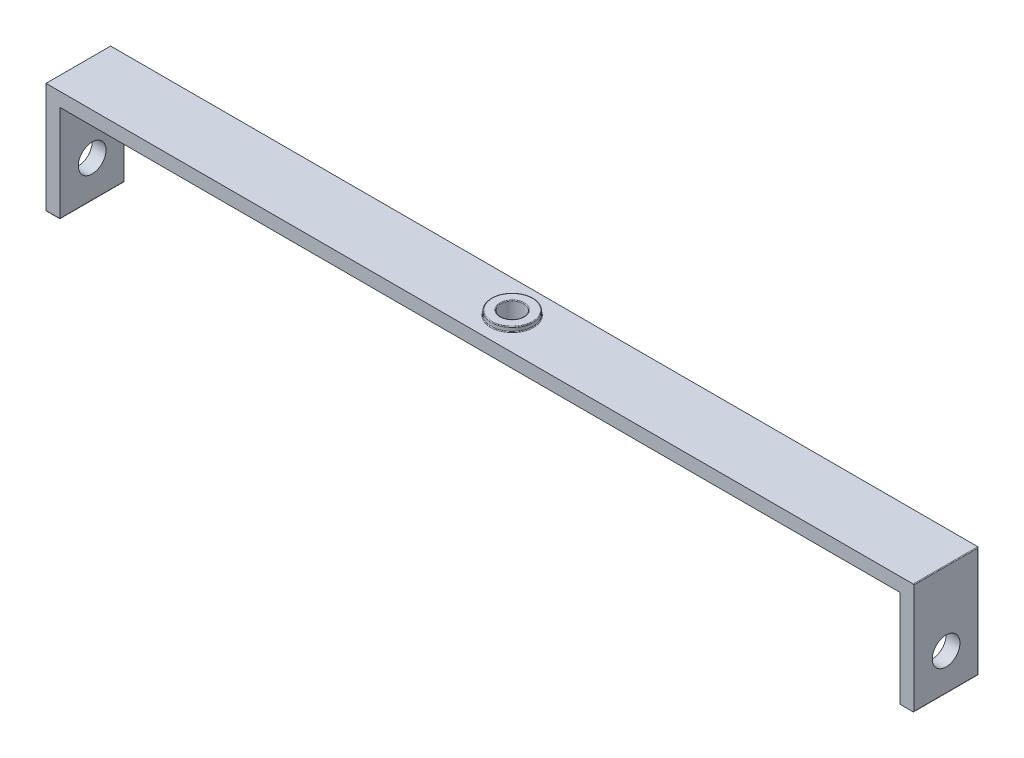
ISO-10303-21;
HEADER;
FILE_DESCRIPTION(('STEP AP214'),'2;1');
FILE_NAME('part.step','',(''),(''),'','','');
FILE_SCHEMA(('AUTOMOTIVE_DESIGN { 1 0 10303 214 1 1 1 1 }'));
ENDSEC;
DATA;
#1=APPLICATION_CONTEXT('core data for automotive mechanical design processes');
#2=APPLICATION_PROTOCOL_DEFINITION('international standard','automotive_design',2000,#1);
#3=PRODUCT_CONTEXT('',#1,'mechanical');
#4=PRODUCT('Part','Part','',(#3));
#5=PRODUCT_RELATED_PRODUCT_CATEGORY('part','',(#4));
#6=PRODUCT_DEFINITION_FORMATION('','',#4);
#7=PRODUCT_DEFINITION_CONTEXT('part definition',#1,'design');
#8=PRODUCT_DEFINITION('design','',#6,#7);
#9=PRODUCT_DEFINITION_SHAPE('','',#8);
#10=(LENGTH_UNIT() NAMED_UNIT(*) SI_UNIT(.MILLI.,.METRE.));
#11=(NAMED_UNIT(*) PLANE_ANGLE_UNIT() SI_UNIT($,.RADIAN.));
#12=(NAMED_UNIT(*) SI_UNIT($,.STERADIAN.) SOLID_ANGLE_UNIT());
#13=UNCERTAINTY_MEASURE_WITH_UNIT(LENGTH_MEASURE(1.E-05),#10,'distance_accuracy_value','');
#14=(GEOMETRIC_REPRESENTATION_CONTEXT(3) GLOBAL_UNCERTAINTY_ASSIGNED_CONTEXT((#13)) GLOBAL_UNIT_ASSIGNED_CONTEXT((#10,
#11,#12)) REPRESENTATION_CONTEXT('',''));
#15=CARTESIAN_POINT('',(0.,0.,0.));
#16=DIRECTION('',(0.,0.,1.));
#17=DIRECTION('',(1.,0.,0.));
#18=AXIS2_PLACEMENT_3D('',#15,#16,#17);
#19=CARTESIAN_POINT('',(-47.,0.,3.5));
#20=DIRECTION('',(0.,-1.,0.));
#21=DIRECTION('',(0.,0.,-1.));
#22=AXIS2_PLACEMENT_3D('',#19,#20,#21);
#23=PLANE('',#22);
#24=CARTESIAN_POINT('',(0.,0.,0.));
#25=DIRECTION('',(0.,-1.,0.));
#26=DIRECTION('',(0.,0.,-1.));
#27=AXIS2_PLACEMENT_3D('',#24,#25,#26);
#28=CIRCLE('',#27,2.325);
#29=CARTESIAN_POINT('',(0.,0.,-2.325));
#30=VERTEX_POINT('',#29);
#31=EDGE_CURVE('E251',#30,#30,#28,.T.);
#32=ORIENTED_EDGE('',*,*,#31,.T.);
#33=EDGE_LOOP('',(#32));
#34=FACE_BOUND('',#33,.T.);
#35=DIRECTION('',(-1.,0.,0.));
#36=VECTOR('',#35,1.);
#37=CARTESIAN_POINT('',(-47.,0.,3.5));
#38=LINE('',#37,#36);
#39=CARTESIAN_POINT('',(46.925,0.,3.5));
#40=VERTEX_POINT('',#39);
#41=CARTESIAN_POINT('',(-47.,0.,3.5));
#42=VERTEX_POINT('',#41);
#43=EDGE_CURVE('E163',#40,#42,#38,.T.);
#44=ORIENTED_EDGE('',*,*,#43,.F.);
#45=DIRECTION('',(0.,0.,-1.));
#46=VECTOR('',#45,1.);
#47=CARTESIAN_POINT('',(46.925,0.,3.5));
#48=LINE('',#47,#46);
#49=CARTESIAN_POINT('',(46.925,0.,-3.5));
#50=VERTEX_POINT('',#49);
#51=EDGE_CURVE('E249',#40,#50,#48,.T.);
#52=ORIENTED_EDGE('',*,*,#51,.T.);
#53=DIRECTION('',(-1.,0.,0.));
#54=VECTOR('',#53,1.);
#55=CARTESIAN_POINT('',(-47.,0.,-3.5));
#56=LINE('',#55,#54);
#57=CARTESIAN_POINT('',(-47.,0.,-3.5));
#58=VERTEX_POINT('',#57);
#59=EDGE_CURVE('E180',#50,#58,#56,.T.);
#60=ORIENTED_EDGE('',*,*,#59,.T.);
#61=DIRECTION('',(0.,0.,-1.));
#62=VECTOR('',#61,1.);
#63=CARTESIAN_POINT('',(-47.,0.,3.5));
#64=LINE('',#63,#62);
#65=EDGE_CURVE('E178',#42,#58,#64,.T.);
#66=ORIENTED_EDGE('',*,*,#65,.F.);
#67=EDGE_LOOP('',(#44,#52,#60,#66));
#68=FACE_BOUND('',#67,.T.);
#69=ADVANCED_FACE('F35',(#34,#68),#23,.F.);
#70=CARTESIAN_POINT('',(45.5,-12.,3.5));
#71=DIRECTION('',(0.,1.,0.));
#72=DIRECTION('',(0.,0.,1.));
#73=AXIS2_PLACEMENT_3D('',#70,#71,#72);
#74=PLANE('',#73);
#75=DIRECTION('',(1.,0.,0.));
#76=VECTOR('',#75,1.);
#77=CARTESIAN_POINT('',(47.,-12.,-3.425));
#78=LINE('',#77,#76);
#79=CARTESIAN_POINT('',(45.575,-12.,-3.425));
#80=VERTEX_POINT('',#79);
#81=CARTESIAN_POINT('',(46.925,-12.,-3.425));
#82=VERTEX_POINT('',#81);
#83=EDGE_CURVE('E260',#80,#82,#78,.T.);
#84=ORIENTED_EDGE('',*,*,#83,.T.);
#85=DIRECTION('',(0.,0.,-1.));
#86=VECTOR('',#85,1.);
#87=CARTESIAN_POINT('',(46.925,-12.,3.5));
#88=LINE('',#87,#86);
#89=CARTESIAN_POINT('',(46.925,-12.,3.5));
#90=VERTEX_POINT('',#89);
#91=EDGE_CURVE('E264',#82,#90,#88,.F.);
#92=ORIENTED_EDGE('',*,*,#91,.T.);
#93=DIRECTION('',(1.,0.,0.));
#94=VECTOR('',#93,1.);
#95=CARTESIAN_POINT('',(45.5,-12.,3.5));
#96=LINE('',#95,#94);
#97=CARTESIAN_POINT('',(45.575,-12.,3.5));
#98=VERTEX_POINT('',#97);
#99=EDGE_CURVE('E204',#98,#90,#96,.T.);
#100=ORIENTED_EDGE('',*,*,#99,.F.);
#101=DIRECTION('',(0.,0.,-1.));
#102=VECTOR('',#101,1.);
#103=CARTESIAN_POINT('',(45.575,-12.,3.5));
#104=LINE('',#103,#102);
#105=EDGE_CURVE('E262',#98,#80,#104,.T.);
#106=ORIENTED_EDGE('',*,*,#105,.T.);
#107=EDGE_LOOP('',(#84,#92,#100,#106));
#108=FACE_BOUND('',#107,.T.);
#109=ADVANCED_FACE('F445',(#108),#74,.F.);
#110=CARTESIAN_POINT('',(47.,0.,3.5));
#111=DIRECTION('',(-1.,0.,0.));
#112=DIRECTION('',(0.,0.,1.));
#113=AXIS2_PLACEMENT_3D('',#110,#111,#112);
#114=PLANE('',#113);
#115=DIRECTION('',(0.,1.,0.));
#116=VECTOR('',#115,1.);
#117=CARTESIAN_POINT('',(47.,0.,3.5));
#118=LINE('',#117,#116);
#119=CARTESIAN_POINT('',(47.,-11.925,3.5));
#120=VERTEX_POINT('',#119);
#121=CARTESIAN_POINT('',(47.,-0.075,3.5));
#122=VERTEX_POINT('',#121);
#123=EDGE_CURVE('E175',#120,#122,#118,.T.);
#124=ORIENTED_EDGE('',*,*,#123,.F.);
#125=DIRECTION('',(0.,0.,-1.));
#126=VECTOR('',#125,1.);
#127=CARTESIAN_POINT('',(47.,-11.925,3.5));
#128=LINE('',#127,#126);
#129=CARTESIAN_POINT('',(47.,-11.925,-3.425));
#130=VERTEX_POINT('',#129);
#131=EDGE_CURVE('E258',#120,#130,#128,.T.);
#132=ORIENTED_EDGE('',*,*,#131,.T.);
#133=DIRECTION('',(0.,1.,0.));
#134=VECTOR('',#133,1.);
#135=CARTESIAN_POINT('',(47.,0.,-3.425));
#136=LINE('',#135,#134);
#137=CARTESIAN_POINT('',(47.,-0.075,-3.425));
#138=VERTEX_POINT('',#137);
#139=EDGE_CURVE('E254',#130,#138,#136,.T.);
#140=ORIENTED_EDGE('',*,*,#139,.T.);
#141=DIRECTION('',(0.,0.,-1.));
#142=VECTOR('',#141,1.);
#143=CARTESIAN_POINT('',(47.,-0.075,3.5));
#144=LINE('',#143,#142);
#145=EDGE_CURVE('E256',#138,#122,#144,.F.);
#146=ORIENTED_EDGE('',*,*,#145,.T.);
#147=EDGE_LOOP('',(#124,#132,#140,#146));
#148=FACE_BOUND('',#147,.T.);
#149=CARTESIAN_POINT('',(47.,-8.,0.));
#150=DIRECTION('',(1.,0.,0.));
#151=DIRECTION('',(0.,0.,-1.));
#152=AXIS2_PLACEMENT_3D('',#149,#150,#151);
#153=CIRCLE('',#152,1.5);
#154=CARTESIAN_POINT('',(47.,-8.,-1.5));
#155=VERTEX_POINT('',#154);
#156=EDGE_CURVE('E355',#155,#155,#153,.T.);
#157=ORIENTED_EDGE('',*,*,#156,.F.);
#158=EDGE_LOOP('',(#157));
#159=FACE_BOUND('',#158,.T.);
#160=ADVANCED_FACE('F450',(#148,#159),#114,.F.);
#161=CARTESIAN_POINT('',(-47.,0.,3.5));
#162=DIRECTION('',(1.,0.,0.));
#163=DIRECTION('',(0.,0.,-1.));
#164=AXIS2_PLACEMENT_3D('',#161,#162,#163);
#165=PLANE('',#164);
#166=CARTESIAN_POINT('',(-47.,-8.,0.));
#167=DIRECTION('',(1.,0.,0.));
#168=DIRECTION('',(0.,0.,-1.));
#169=AXIS2_PLACEMENT_3D('',#166,#167,#168);
#170=CIRCLE('',#169,1.5);
#171=CARTESIAN_POINT('',(-47.,-8.,-1.5));
#172=VERTEX_POINT('',#171);
#173=EDGE_CURVE('E209',#172,#172,#170,.T.);
#174=ORIENTED_EDGE('',*,*,#173,.T.);
#175=EDGE_LOOP('',(#174));
#176=FACE_BOUND('',#175,.T.);
#177=DIRECTION('',(0.,-1.,0.));
#178=VECTOR('',#177,1.);
#179=CARTESIAN_POINT('',(-47.,0.,-3.5));
#180=LINE('',#179,#178);
#181=CARTESIAN_POINT('',(-47.,-11.925,-3.5));
#182=VERTEX_POINT('',#181);
#183=EDGE_CURVE('E202',#58,#182,#180,.T.);
#184=ORIENTED_EDGE('',*,*,#183,.T.);
#185=DIRECTION('',(0.,0.,-1.));
#186=VECTOR('',#185,1.);
#187=CARTESIAN_POINT('',(-47.,-11.925,3.5));
#188=LINE('',#187,#186);
#189=CARTESIAN_POINT('',(-47.,-11.925,3.5));
#190=VERTEX_POINT('',#189);
#191=EDGE_CURVE('E189',#182,#190,#188,.F.);
#192=ORIENTED_EDGE('',*,*,#191,.T.);
#193=DIRECTION('',(0.,-1.,0.));
#194=VECTOR('',#193,1.);
#195=CARTESIAN_POINT('',(-47.,0.,3.5));
#196=LINE('',#195,#194);
#197=EDGE_CURVE('E168',#42,#190,#196,.T.);
#198=ORIENTED_EDGE('',*,*,#197,.F.);
#199=ORIENTED_EDGE('',*,*,#65,.T.);
#200=EDGE_LOOP('',(#184,#192,#198,#199));
#201=FACE_BOUND('',#200,.T.);
#202=ADVANCED_FACE('F187',(#176,#201),#165,.F.);
#203=CARTESIAN_POINT('',(-47.,-12.,3.5));
#204=DIRECTION('',(0.,1.,0.));
#205=DIRECTION('',(0.,0.,1.));
#206=AXIS2_PLACEMENT_3D('',#203,#204,#205);
#207=PLANE('',#206);
#208=DIRECTION('',(0.,0.,-1.));
#209=VECTOR('',#208,1.);
#210=CARTESIAN_POINT('',(-45.575,-12.,3.5));
#211=LINE('',#210,#209);
#212=CARTESIAN_POINT('',(-45.575,-12.,-3.425));
#213=VERTEX_POINT('',#212);
#214=CARTESIAN_POINT('',(-45.575,-12.,3.425));
#215=VERTEX_POINT('',#214);
#216=EDGE_CURVE('E275',#213,#215,#211,.F.);
#217=ORIENTED_EDGE('',*,*,#216,.T.);
#218=DIRECTION('',(1.,0.,0.));
#219=VECTOR('',#218,1.);
#220=CARTESIAN_POINT('',(-47.,-12.,3.425));
#221=LINE('',#220,#219);
#222=CARTESIAN_POINT('',(-46.925,-12.,3.425));
#223=VERTEX_POINT('',#222);
#224=EDGE_CURVE('E280',#215,#223,#221,.F.);
#225=ORIENTED_EDGE('',*,*,#224,.T.);
#226=DIRECTION('',(0.,0.,-1.));
#227=VECTOR('',#226,1.);
#228=CARTESIAN_POINT('',(-46.925,-12.,3.5));
#229=LINE('',#228,#227);
#230=CARTESIAN_POINT('',(-46.925,-12.,-3.425));
#231=VERTEX_POINT('',#230);
#232=EDGE_CURVE('E277',#223,#231,#229,.T.);
#233=ORIENTED_EDGE('',*,*,#232,.T.);
#234=DIRECTION('',(1.,0.,0.));
#235=VECTOR('',#234,1.);
#236=CARTESIAN_POINT('',(-45.5,-12.,-3.425));
#237=LINE('',#236,#235);
#238=EDGE_CURVE('E273',#231,#213,#237,.T.);
#239=ORIENTED_EDGE('',*,*,#238,.T.);
#240=EDGE_LOOP('',(#217,#225,#233,#239));
#241=FACE_BOUND('',#240,.T.);
#242=ADVANCED_FACE('F390',(#241),#207,.F.);
#243=CARTESIAN_POINT('',(-45.5,-1.5,3.5));
#244=DIRECTION('',(-1.,0.,0.));
#245=DIRECTION('',(0.,0.,1.));
#246=AXIS2_PLACEMENT_3D('',#243,#244,#245);
#247=PLANE('',#246);
#248=CARTESIAN_POINT('',(-45.5,-8.,0.));
#249=DIRECTION('',(-1.,0.,0.));
#250=DIRECTION('',(0.,0.,1.));
#251=AXIS2_PLACEMENT_3D('',#248,#249,#250);
#252=CIRCLE('',#251,1.5);
#253=CARTESIAN_POINT('',(-45.5,-8.,1.5));
#254=VERTEX_POINT('',#253);
#255=EDGE_CURVE('E203',#254,#254,#252,.T.);
#256=ORIENTED_EDGE('',*,*,#255,.T.);
#257=EDGE_LOOP('',(#256));
#258=FACE_BOUND('',#257,.T.);
#259=DIRECTION('',(0.,1.,0.));
#260=VECTOR('',#259,1.);
#261=CARTESIAN_POINT('',(-45.5,-1.5,3.5));
#262=LINE('',#261,#260);
#263=CARTESIAN_POINT('',(-45.5,-11.925,3.5));
#264=VERTEX_POINT('',#263);
#265=CARTESIAN_POINT('',(-45.5,-1.575,3.5));
#266=VERTEX_POINT('',#265);
#267=EDGE_CURVE('E190',#264,#266,#262,.T.);
#268=ORIENTED_EDGE('',*,*,#267,.F.);
#269=DIRECTION('',(0.,0.,-1.));
#270=VECTOR('',#269,1.);
#271=CARTESIAN_POINT('',(-45.5,-11.925,3.5));
#272=LINE('',#271,#270);
#273=CARTESIAN_POINT('',(-45.5,-11.925,-3.425));
#274=VERTEX_POINT('',#273);
#275=EDGE_CURVE('E214',#264,#274,#272,.T.);
#276=ORIENTED_EDGE('',*,*,#275,.T.);
#277=DIRECTION('',(0.,1.,0.));
#278=VECTOR('',#277,1.);
#279=CARTESIAN_POINT('',(-45.5,-1.5,-3.425));
#280=LINE('',#279,#278);
#281=CARTESIAN_POINT('',(-45.5,-1.575,-3.425));
#282=VERTEX_POINT('',#281);
#283=EDGE_CURVE('E211',#274,#282,#280,.T.);
#284=ORIENTED_EDGE('',*,*,#283,.T.);
#285=DIRECTION('',(0.,0.,-1.));
#286=VECTOR('',#285,1.);
#287=CARTESIAN_POINT('',(-45.5,-1.575,3.5));
#288=LINE('',#287,#286);
#289=EDGE_CURVE('E184',#282,#266,#288,.F.);
#290=ORIENTED_EDGE('',*,*,#289,.T.);
#291=EDGE_LOOP('',(#268,#276,#284,#290));
#292=FACE_BOUND('',#291,.T.);
#293=ADVANCED_FACE('F403',(#258,#292),#247,.F.);
#294=CARTESIAN_POINT('',(-45.5,-1.5,3.5));
#295=DIRECTION('',(0.,1.,0.));
#296=DIRECTION('',(0.,0.,1.));
#297=AXIS2_PLACEMENT_3D('',#294,#295,#296);
#298=PLANE('',#297);
#299=CARTESIAN_POINT('',(0.,-1.5,0.));
#300=DIRECTION('',(0.,1.,0.));
#301=DIRECTION('',(0.,0.,1.));
#302=AXIS2_PLACEMENT_3D('',#299,#300,#301);
#303=CIRCLE('',#302,1.325);
#304=CARTESIAN_POINT('',(0.,-1.5,1.325));
#305=VERTEX_POINT('',#304);
#306=EDGE_CURVE('E234',#305,#305,#303,.T.);
#307=ORIENTED_EDGE('',*,*,#306,.T.);
#308=EDGE_LOOP('',(#307));
#309=FACE_BOUND('',#308,.T.);
#310=DIRECTION('',(1.,0.,0.));
#311=VECTOR('',#310,1.);
#312=CARTESIAN_POINT('',(-45.5,-1.5,3.5));
#313=LINE('',#312,#311);
#314=CARTESIAN_POINT('',(-45.425,-1.5,3.5));
#315=VERTEX_POINT('',#314);
#316=CARTESIAN_POINT('',(45.425,-1.5,3.5));
#317=VERTEX_POINT('',#316);
#318=EDGE_CURVE('E193',#315,#317,#313,.T.);
#319=ORIENTED_EDGE('',*,*,#318,.F.);
#320=DIRECTION('',(0.,0.,-1.));
#321=VECTOR('',#320,1.);
#322=CARTESIAN_POINT('',(-45.425,-1.5,-3.5));
#323=LINE('',#322,#321);
#324=CARTESIAN_POINT('',(-45.425,-1.5,-3.425));
#325=VERTEX_POINT('',#324);
#326=EDGE_CURVE('E241',#315,#325,#323,.T.);
#327=ORIENTED_EDGE('',*,*,#326,.T.);
#328=DIRECTION('',(1.,0.,0.));
#329=VECTOR('',#328,1.);
#330=CARTESIAN_POINT('',(45.5,-1.5,-3.425));
#331=LINE('',#330,#329);
#332=CARTESIAN_POINT('',(45.425,-1.5,-3.425));
#333=VERTEX_POINT('',#332);
#334=EDGE_CURVE('E239',#325,#333,#331,.T.);
#335=ORIENTED_EDGE('',*,*,#334,.T.);
#336=DIRECTION('',(0.,0.,-1.));
#337=VECTOR('',#336,1.);
#338=CARTESIAN_POINT('',(45.425,-1.5,3.5));
#339=LINE('',#338,#337);
#340=EDGE_CURVE('E237',#333,#317,#339,.F.);
#341=ORIENTED_EDGE('',*,*,#340,.T.);
#342=EDGE_LOOP('',(#319,#327,#335,#341));
#343=FACE_BOUND('',#342,.T.);
#344=ADVANCED_FACE('F413',(#309,#343),#298,.F.);
#345=CARTESIAN_POINT('',(45.5,-1.5,3.5));
#346=DIRECTION('',(1.,0.,0.));
#347=DIRECTION('',(0.,0.,-1.));
#348=AXIS2_PLACEMENT_3D('',#345,#346,#347);
#349=PLANE('',#348);
#350=DIRECTION('',(0.,-1.,0.));
#351=VECTOR('',#350,1.);
#352=CARTESIAN_POINT('',(45.5,-1.5,3.5));
#353=LINE('',#352,#351);
#354=CARTESIAN_POINT('',(45.5,-1.575,3.5));
#355=VERTEX_POINT('',#354);
#356=CARTESIAN_POINT('',(45.5,-11.925,3.5));
#357=VERTEX_POINT('',#356);
#358=EDGE_CURVE('E185',#355,#357,#353,.T.);
#359=ORIENTED_EDGE('',*,*,#358,.F.);
#360=DIRECTION('',(0.,0.,-1.));
#361=VECTOR('',#360,1.);
#362=CARTESIAN_POINT('',(45.5,-1.575,-3.5));
#363=LINE('',#362,#361);
#364=CARTESIAN_POINT('',(45.5,-1.575,-3.425));
#365=VERTEX_POINT('',#364);
#366=EDGE_CURVE('E57',#355,#365,#363,.T.);
#367=ORIENTED_EDGE('',*,*,#366,.T.);
#368=DIRECTION('',(0.,-1.,0.));
#369=VECTOR('',#368,1.);
#370=CARTESIAN_POINT('',(45.5,-12.,-3.425));
#371=LINE('',#370,#369);
#372=CARTESIAN_POINT('',(45.5,-11.925,-3.425));
#373=VERTEX_POINT('',#372);
#374=EDGE_CURVE('E52',#365,#373,#371,.T.);
#375=ORIENTED_EDGE('',*,*,#374,.T.);
#376=DIRECTION('',(0.,0.,-1.));
#377=VECTOR('',#376,1.);
#378=CARTESIAN_POINT('',(45.5,-11.925,3.5));
#379=LINE('',#378,#377);
#380=EDGE_CURVE('E284',#373,#357,#379,.F.);
#381=ORIENTED_EDGE('',*,*,#380,.T.);
#382=EDGE_LOOP('',(#359,#367,#375,#381));
#383=FACE_BOUND('',#382,.T.);
#384=CARTESIAN_POINT('',(45.5,-8.,0.));
#385=DIRECTION('',(1.,0.,0.));
#386=DIRECTION('',(0.,0.,-1.));
#387=AXIS2_PLACEMENT_3D('',#384,#385,#386);
#388=CIRCLE('',#387,1.5);
#389=CARTESIAN_POINT('',(45.5,-8.,-1.5));
#390=VERTEX_POINT('',#389);
#391=EDGE_CURVE('E206',#390,#390,#388,.T.);
#392=ORIENTED_EDGE('',*,*,#391,.T.);
#393=EDGE_LOOP('',(#392));
#394=FACE_BOUND('',#393,.T.);
#395=ADVANCED_FACE('F441',(#383,#394),#349,.F.);
#396=CARTESIAN_POINT('',(0.,0.,3.5));
#397=DIRECTION('',(0.,0.,-1.));
#398=DIRECTION('',(-1.,0.,0.));
#399=AXIS2_PLACEMENT_3D('',#396,#397,#398);
#400=PLANE('',#399);
#401=ORIENTED_EDGE('',*,*,#99,.T.);
#402=CARTESIAN_POINT('',(46.925,-11.925,3.5));
#403=DIRECTION('',(0.,0.,-1.));
#404=DIRECTION('',(-1.,0.,0.));
#405=AXIS2_PLACEMENT_3D('',#402,#403,#404);
#406=CIRCLE('',#405,0.075);
#407=EDGE_CURVE('E271',#90,#120,#406,.F.);
#408=ORIENTED_EDGE('',*,*,#407,.T.);
#409=ORIENTED_EDGE('',*,*,#123,.T.);
#410=CARTESIAN_POINT('',(46.925,-0.075,3.5));
#411=DIRECTION('',(0.,0.,-1.));
#412=DIRECTION('',(-1.,0.,0.));
#413=AXIS2_PLACEMENT_3D('',#410,#411,#412);
#414=CIRCLE('',#413,0.075);
#415=EDGE_CURVE('E172',#122,#40,#414,.F.);
#416=ORIENTED_EDGE('',*,*,#415,.T.);
#417=ORIENTED_EDGE('',*,*,#43,.T.);
#418=ORIENTED_EDGE('',*,*,#197,.T.);
#419=DIRECTION('',(1.,0.,0.));
#420=VECTOR('',#419,1.);
#421=CARTESIAN_POINT('',(0.,-11.925,3.5));
#422=LINE('',#421,#420);
#423=EDGE_CURVE('E266',#190,#264,#422,.T.);
#424=ORIENTED_EDGE('',*,*,#423,.T.);
#425=ORIENTED_EDGE('',*,*,#267,.T.);
#426=CARTESIAN_POINT('',(-45.425,-1.575,3.5));
#427=DIRECTION('',(0.,0.,-1.));
#428=DIRECTION('',(-1.,0.,0.));
#429=AXIS2_PLACEMENT_3D('',#426,#427,#428);
#430=CIRCLE('',#429,0.075);
#431=EDGE_CURVE('E44',#266,#315,#430,.T.);
#432=ORIENTED_EDGE('',*,*,#431,.T.);
#433=ORIENTED_EDGE('',*,*,#318,.T.);
#434=CARTESIAN_POINT('',(45.425,-1.575,3.5));
#435=DIRECTION('',(0.,0.,-1.));
#436=DIRECTION('',(-1.,0.,0.));
#437=AXIS2_PLACEMENT_3D('',#434,#435,#436);
#438=CIRCLE('',#437,0.075);
#439=EDGE_CURVE('E11',#317,#355,#438,.T.);
#440=ORIENTED_EDGE('',*,*,#439,.T.);
#441=ORIENTED_EDGE('',*,*,#358,.T.);
#442=CARTESIAN_POINT('',(45.575,-11.925,3.5));
#443=DIRECTION('',(0.,0.,-1.));
#444=DIRECTION('',(-1.,0.,0.));
#445=AXIS2_PLACEMENT_3D('',#442,#443,#444);
#446=CIRCLE('',#445,0.075);
#447=EDGE_CURVE('E268',#357,#98,#446,.F.);
#448=ORIENTED_EDGE('',*,*,#447,.T.);
#449=EDGE_LOOP('',(#401,#408,#409,#416,#417,#418,#424,#425,#432,#433,#440,#441,#448));
#450=FACE_BOUND('',#449,.T.);
#451=ADVANCED_FACE('F166',(#450),#400,.F.);
#452=CARTESIAN_POINT('',(0.,0.,-3.5));
#453=DIRECTION('',(0.,0.,-1.));
#454=DIRECTION('',(-1.,0.,0.));
#455=AXIS2_PLACEMENT_3D('',#452,#453,#454);
#456=PLANE('',#455);
#457=DIRECTION('',(0.,1.,0.));
#458=VECTOR('',#457,1.);
#459=CARTESIAN_POINT('',(-45.575,-12.,-3.5));
#460=LINE('',#459,#458);
#461=CARTESIAN_POINT('',(-45.575,-1.575,-3.5));
#462=VERTEX_POINT('',#461);
#463=CARTESIAN_POINT('',(-45.575,-11.925,-3.5));
#464=VERTEX_POINT('',#463);
#465=EDGE_CURVE('E230',#462,#464,#460,.F.);
#466=ORIENTED_EDGE('',*,*,#465,.T.);
#467=DIRECTION('',(1.,0.,0.));
#468=VECTOR('',#467,1.);
#469=CARTESIAN_POINT('',(-47.,-11.925,-3.5));
#470=LINE('',#469,#468);
#471=EDGE_CURVE('E232',#464,#182,#470,.F.);
#472=ORIENTED_EDGE('',*,*,#471,.T.);
#473=ORIENTED_EDGE('',*,*,#183,.F.);
#474=ORIENTED_EDGE('',*,*,#59,.F.);
#475=DIRECTION('',(0.,1.,0.));
#476=VECTOR('',#475,1.);
#477=CARTESIAN_POINT('',(46.925,-12.,-3.5));
#478=LINE('',#477,#476);
#479=CARTESIAN_POINT('',(46.925,-11.925,-3.5));
#480=VERTEX_POINT('',#479);
#481=EDGE_CURVE('E218',#50,#480,#478,.F.);
#482=ORIENTED_EDGE('',*,*,#481,.T.);
#483=DIRECTION('',(1.,0.,0.));
#484=VECTOR('',#483,1.);
#485=CARTESIAN_POINT('',(45.5,-11.925,-3.5));
#486=LINE('',#485,#484);
#487=CARTESIAN_POINT('',(45.575,-11.925,-3.5));
#488=VERTEX_POINT('',#487);
#489=EDGE_CURVE('E216',#480,#488,#486,.F.);
#490=ORIENTED_EDGE('',*,*,#489,.T.);
#491=DIRECTION('',(0.,-1.,0.));
#492=VECTOR('',#491,1.);
#493=CARTESIAN_POINT('',(45.575,-1.5,-3.5));
#494=LINE('',#493,#492);
#495=CARTESIAN_POINT('',(45.575,-1.575,-3.5));
#496=VERTEX_POINT('',#495);
#497=EDGE_CURVE('E220',#488,#496,#494,.F.);
#498=ORIENTED_EDGE('',*,*,#497,.T.);
#499=CARTESIAN_POINT('',(45.425,-1.575,-3.5));
#500=DIRECTION('',(0.,0.,-1.));
#501=DIRECTION('',(-1.,0.,0.));
#502=AXIS2_PLACEMENT_3D('',#499,#500,#501);
#503=CIRCLE('',#502,0.15);
#504=CARTESIAN_POINT('',(45.425,-1.425,-3.5));
#505=VERTEX_POINT('',#504);
#506=EDGE_CURVE('E222',#505,#496,#503,.T.);
#507=ORIENTED_EDGE('',*,*,#506,.F.);
#508=DIRECTION('',(1.,0.,0.));
#509=VECTOR('',#508,1.);
#510=CARTESIAN_POINT('',(-45.5,-1.425,-3.5));
#511=LINE('',#510,#509);
#512=CARTESIAN_POINT('',(-45.425,-1.425,-3.5));
#513=VERTEX_POINT('',#512);
#514=EDGE_CURVE('E225',#505,#513,#511,.F.);
#515=ORIENTED_EDGE('',*,*,#514,.T.);
#516=CARTESIAN_POINT('',(-45.425,-1.575,-3.5));
#517=DIRECTION('',(0.,0.,-1.));
#518=DIRECTION('',(-1.,0.,0.));
#519=AXIS2_PLACEMENT_3D('',#516,#517,#518);
#520=CIRCLE('',#519,0.15);
#521=EDGE_CURVE('E227',#462,#513,#520,.T.);
#522=ORIENTED_EDGE('',*,*,#521,.F.);
#523=EDGE_LOOP('',(#466,#472,#473,#474,#482,#490,#498,#507,#515,#522));
#524=FACE_BOUND('',#523,.T.);
#525=ADVANCED_FACE('F377',(#524),#456,.T.);
#526=CARTESIAN_POINT('',(0.,-12.,0.));
#527=DIRECTION('',(0.,1.,0.));
#528=DIRECTION('',(0.,0.,1.));
#529=AXIS2_PLACEMENT_3D('',#526,#527,#528);
#530=CYLINDRICAL_SURFACE('',#529,1.25);
#531=CARTESIAN_POINT('',(0.,-1.425,0.));
#532=DIRECTION('',(0.,1.,0.));
#533=DIRECTION('',(0.,0.,1.));
#534=AXIS2_PLACEMENT_3D('',#531,#532,#533);
#535=CIRCLE('',#534,1.25);
#536=CARTESIAN_POINT('',(0.,-1.425,1.25));
#537=VERTEX_POINT('',#536);
#538=EDGE_CURVE('E290',#537,#537,#535,.F.);
#539=ORIENTED_EDGE('',*,*,#538,.T.);
#540=EDGE_LOOP('',(#539));
#541=FACE_BOUND('',#540,.T.);
#542=CARTESIAN_POINT('',(0.,0.425,0.));
#543=DIRECTION('',(0.,1.,0.));
#544=DIRECTION('',(0.,0.,1.));
#545=AXIS2_PLACEMENT_3D('',#542,#543,#544);
#546=CIRCLE('',#545,1.25);
#547=CARTESIAN_POINT('',(0.,0.425,1.25));
#548=VERTEX_POINT('',#547);
#549=EDGE_CURVE('E287',#548,#548,#546,.T.);
#550=ORIENTED_EDGE('',*,*,#549,.T.);
#551=EDGE_LOOP('',(#550));
#552=FACE_BOUND('',#551,.T.);
#553=ADVANCED_FACE('F693',(#541,#552),#530,.F.);
#554=CARTESIAN_POINT('',(0.,0.5,0.));
#555=DIRECTION('',(0.,1.,0.));
#556=DIRECTION('',(0.,0.,1.));
#557=AXIS2_PLACEMENT_3D('',#554,#555,#556);
#558=PLANE('',#557);
#559=CARTESIAN_POINT('',(0.,0.5,0.));
#560=DIRECTION('',(0.,1.,0.));
#561=DIRECTION('',(0.,0.,1.));
#562=AXIS2_PLACEMENT_3D('',#559,#560,#561);
#563=CIRCLE('',#562,2.175);
#564=CARTESIAN_POINT('',(0.,0.5,2.175));
#565=VERTEX_POINT('',#564);
#566=EDGE_CURVE('E296',#565,#565,#563,.T.);
#567=ORIENTED_EDGE('',*,*,#566,.T.);
#568=EDGE_LOOP('',(#567));
#569=FACE_BOUND('',#568,.T.);
#570=CARTESIAN_POINT('',(0.,0.5,0.));
#571=DIRECTION('',(0.,1.,0.));
#572=DIRECTION('',(0.,0.,1.));
#573=AXIS2_PLACEMENT_3D('',#570,#571,#572);
#574=CIRCLE('',#573,1.325);
#575=CARTESIAN_POINT('',(0.,0.5,1.325));
#576=VERTEX_POINT('',#575);
#577=EDGE_CURVE('E293',#576,#576,#574,.F.);
#578=ORIENTED_EDGE('',*,*,#577,.T.);
#579=EDGE_LOOP('',(#578));
#580=FACE_BOUND('',#579,.T.);
#581=ADVANCED_FACE('F684',(#569,#580),#558,.T.);
#582=CARTESIAN_POINT('',(0.,0.5,0.));
#583=DIRECTION('',(0.,-1.,0.));
#584=DIRECTION('',(0.,0.,-1.));
#585=AXIS2_PLACEMENT_3D('',#582,#583,#584);
#586=CYLINDRICAL_SURFACE('',#585,2.25);
#587=CARTESIAN_POINT('',(0.,0.075,0.));
#588=DIRECTION('',(0.,-1.,0.));
#589=DIRECTION('',(0.,0.,-1.));
#590=AXIS2_PLACEMENT_3D('',#587,#588,#589);
#591=CIRCLE('',#590,2.25);
#592=CARTESIAN_POINT('',(0.,0.075,-2.25));
#593=VERTEX_POINT('',#592);
#594=EDGE_CURVE('E246',#593,#593,#591,.F.);
#595=ORIENTED_EDGE('',*,*,#594,.T.);
#596=EDGE_LOOP('',(#595));
#597=FACE_BOUND('',#596,.T.);
#598=CARTESIAN_POINT('',(0.,0.425,0.));
#599=DIRECTION('',(0.,1.,0.));
#600=DIRECTION('',(0.,0.,1.));
#601=AXIS2_PLACEMENT_3D('',#598,#599,#600);
#602=CIRCLE('',#601,2.25);
#603=CARTESIAN_POINT('',(0.,0.425,2.25));
#604=VERTEX_POINT('',#603);
#605=EDGE_CURVE('E243',#604,#604,#602,.F.);
#606=ORIENTED_EDGE('',*,*,#605,.T.);
#607=EDGE_LOOP('',(#606));
#608=FACE_BOUND('',#607,.T.);
#609=ADVANCED_FACE('F678',(#597,#608),#586,.T.);
#610=CARTESIAN_POINT('',(-47.,-8.,0.));
#611=DIRECTION('',(1.,0.,0.));
#612=DIRECTION('',(0.,0.,-1.));
#613=AXIS2_PLACEMENT_3D('',#610,#611,#612);
#614=CYLINDRICAL_SURFACE('',#613,1.5);
#615=ORIENTED_EDGE('',*,*,#156,.T.);
#616=EDGE_LOOP('',(#615));
#617=FACE_BOUND('',#616,.T.);
#618=ORIENTED_EDGE('',*,*,#391,.F.);
#619=EDGE_LOOP('',(#618));
#620=FACE_BOUND('',#619,.T.);
#621=ADVANCED_FACE('F669',(#617,#620),#614,.F.);
#622=ORIENTED_EDGE('',*,*,#173,.F.);
#623=EDGE_LOOP('',(#622));
#624=FACE_BOUND('',#623,.T.);
#625=ORIENTED_EDGE('',*,*,#255,.F.);
#626=EDGE_LOOP('',(#625));
#627=FACE_BOUND('',#626,.T.);
#628=ADVANCED_FACE('F660',(#624,#627),#614,.F.);
#629=CARTESIAN_POINT('',(46.925,-0.075,3.5));
#630=DIRECTION('',(0.,0.,-1.));
#631=DIRECTION('',(-1.,0.,0.));
#632=AXIS2_PLACEMENT_3D('',#629,#630,#631);
#633=CYLINDRICAL_SURFACE('',#632,0.075);
#634=ORIENTED_EDGE('',*,*,#415,.F.);
#635=ORIENTED_EDGE('',*,*,#145,.F.);
#636=CARTESIAN_POINT('',(46.925,-0.075,-3.425));
#637=DIRECTION('',(0.,-0.707106781186547,-0.707106781186547));
#638=DIRECTION('',(0.,-0.707106781186547,0.707106781186547));
#639=AXIS2_PLACEMENT_3D('',#636,#637,#638);
#640=ELLIPSE('',#639,0.106066017177982,0.075);
#641=EDGE_CURVE('E39',#50,#138,#640,.T.);
#642=ORIENTED_EDGE('',*,*,#641,.F.);
#643=ORIENTED_EDGE('',*,*,#51,.F.);
#644=EDGE_LOOP('',(#634,#635,#642,#643));
#645=FACE_BOUND('',#644,.T.);
#646=ADVANCED_FACE('F375',(#645),#633,.T.);
#647=CARTESIAN_POINT('',(46.925,-11.925,3.5));
#648=DIRECTION('',(0.,0.,-1.));
#649=DIRECTION('',(-1.,0.,0.));
#650=AXIS2_PLACEMENT_3D('',#647,#648,#649);
#651=CYLINDRICAL_SURFACE('',#650,0.075);
#652=ORIENTED_EDGE('',*,*,#407,.F.);
#653=ORIENTED_EDGE('',*,*,#91,.F.);
#654=CARTESIAN_POINT('',(46.925,-11.925,-3.425));
#655=DIRECTION('',(0.,0.,-1.));
#656=DIRECTION('',(-1.,0.,0.));
#657=AXIS2_PLACEMENT_3D('',#654,#655,#656);
#658=CIRCLE('',#657,0.075);
#659=EDGE_CURVE('E349',#130,#82,#658,.T.);
#660=ORIENTED_EDGE('',*,*,#659,.F.);
#661=ORIENTED_EDGE('',*,*,#131,.F.);
#662=EDGE_LOOP('',(#652,#653,#660,#661));
#663=FACE_BOUND('',#662,.T.);
#664=ADVANCED_FACE('F449',(#663),#651,.T.);
#665=CARTESIAN_POINT('',(46.925,0.,-3.425));
#666=DIRECTION('',(0.,-1.,0.));
#667=DIRECTION('',(0.,0.,-1.));
#668=AXIS2_PLACEMENT_3D('',#665,#666,#667);
#669=CYLINDRICAL_SURFACE('',#668,0.075);
#670=ORIENTED_EDGE('',*,*,#641,.T.);
#671=ORIENTED_EDGE('',*,*,#139,.F.);
#672=CARTESIAN_POINT('',(46.925,-11.925,-3.425));
#673=DIRECTION('',(0.,-1.,0.));
#674=DIRECTION('',(0.,0.,-1.));
#675=AXIS2_PLACEMENT_3D('',#672,#673,#674);
#676=CIRCLE('',#675,0.075);
#677=EDGE_CURVE('E347',#480,#130,#676,.T.);
#678=ORIENTED_EDGE('',*,*,#677,.F.);
#679=ORIENTED_EDGE('',*,*,#481,.F.);
#680=EDGE_LOOP('',(#670,#671,#678,#679));
#681=FACE_BOUND('',#680,.T.);
#682=ADVANCED_FACE('F452',(#681),#669,.T.);
#683=CARTESIAN_POINT('',(46.925,-11.925,-3.425));
#684=DIRECTION('',(0.,0.,1.));
#685=DIRECTION('',(1.,0.,0.));
#686=AXIS2_PLACEMENT_3D('',#683,#684,#685);
#687=SPHERICAL_SURFACE('',#686,0.075);
#688=ORIENTED_EDGE('',*,*,#677,.T.);
#689=ORIENTED_EDGE('',*,*,#659,.T.);
#690=CARTESIAN_POINT('',(46.925,-11.925,-3.425));
#691=DIRECTION('',(1.,0.,0.));
#692=DIRECTION('',(0.,0.,-1.));
#693=AXIS2_PLACEMENT_3D('',#690,#691,#692);
#694=CIRCLE('',#693,0.075);
#695=EDGE_CURVE('E344',#480,#82,#694,.F.);
#696=ORIENTED_EDGE('',*,*,#695,.F.);
#697=EDGE_LOOP('',(#688,#689,#696));
#698=FACE_BOUND('',#697,.T.);
#699=ADVANCED_FACE('F453',(#698),#687,.T.);
#700=CARTESIAN_POINT('',(45.575,-11.925,3.5));
#701=DIRECTION('',(0.,0.,-1.));
#702=DIRECTION('',(-1.,0.,0.));
#703=AXIS2_PLACEMENT_3D('',#700,#701,#702);
#704=CYLINDRICAL_SURFACE('',#703,0.075);
#705=ORIENTED_EDGE('',*,*,#447,.F.);
#706=ORIENTED_EDGE('',*,*,#380,.F.);
#707=CARTESIAN_POINT('',(45.575,-11.925,-3.425));
#708=DIRECTION('',(0.,0.,-1.));
#709=DIRECTION('',(-1.,0.,0.));
#710=AXIS2_PLACEMENT_3D('',#707,#708,#709);
#711=CIRCLE('',#710,0.075);
#712=EDGE_CURVE('E341',#80,#373,#711,.T.);
#713=ORIENTED_EDGE('',*,*,#712,.F.);
#714=ORIENTED_EDGE('',*,*,#105,.F.);
#715=EDGE_LOOP('',(#705,#706,#713,#714));
#716=FACE_BOUND('',#715,.T.);
#717=ADVANCED_FACE('F440',(#716),#704,.T.);
#718=CARTESIAN_POINT('',(45.5,-11.925,-3.425));
#719=DIRECTION('',(-1.,0.,0.));
#720=DIRECTION('',(0.,0.,1.));
#721=AXIS2_PLACEMENT_3D('',#718,#719,#720);
#722=CYLINDRICAL_SURFACE('',#721,0.075);
#723=ORIENTED_EDGE('',*,*,#695,.T.);
#724=ORIENTED_EDGE('',*,*,#83,.F.);
#725=CARTESIAN_POINT('',(45.575,-11.925,-3.425));
#726=DIRECTION('',(-1.,0.,0.));
#727=DIRECTION('',(0.,0.,1.));
#728=AXIS2_PLACEMENT_3D('',#725,#726,#727);
#729=CIRCLE('',#728,0.075);
#730=EDGE_CURVE('E338',#488,#80,#729,.T.);
#731=ORIENTED_EDGE('',*,*,#730,.F.);
#732=ORIENTED_EDGE('',*,*,#489,.F.);
#733=EDGE_LOOP('',(#723,#724,#731,#732));
#734=FACE_BOUND('',#733,.T.);
#735=ADVANCED_FACE('F455',(#734),#722,.T.);
#736=CARTESIAN_POINT('',(45.575,-11.925,-3.425));
#737=DIRECTION('',(0.,0.,1.));
#738=DIRECTION('',(1.,0.,0.));
#739=AXIS2_PLACEMENT_3D('',#736,#737,#738);
#740=SPHERICAL_SURFACE('',#739,0.075);
#741=ORIENTED_EDGE('',*,*,#730,.T.);
#742=ORIENTED_EDGE('',*,*,#712,.T.);
#743=CARTESIAN_POINT('',(45.575,-11.925,-3.425));
#744=DIRECTION('',(0.,-1.,0.));
#745=DIRECTION('',(0.,0.,-1.));
#746=AXIS2_PLACEMENT_3D('',#743,#744,#745);
#747=CIRCLE('',#746,0.075);
#748=EDGE_CURVE('E335',#488,#373,#747,.F.);
#749=ORIENTED_EDGE('',*,*,#748,.F.);
#750=EDGE_LOOP('',(#741,#742,#749));
#751=FACE_BOUND('',#750,.T.);
#752=ADVANCED_FACE('F435',(#751),#740,.T.);
#753=CARTESIAN_POINT('',(45.425,-1.575,3.5));
#754=DIRECTION('',(0.,0.,1.));
#755=DIRECTION('',(1.,0.,0.));
#756=AXIS2_PLACEMENT_3D('',#753,#754,#755);
#757=CYLINDRICAL_SURFACE('',#756,0.075);
#758=ORIENTED_EDGE('',*,*,#439,.F.);
#759=ORIENTED_EDGE('',*,*,#340,.F.);
#760=CARTESIAN_POINT('',(45.425,-1.575,-3.425));
#761=DIRECTION('',(0.,0.,-1.));
#762=DIRECTION('',(-1.,0.,0.));
#763=AXIS2_PLACEMENT_3D('',#760,#761,#762);
#764=CIRCLE('',#763,0.075);
#765=EDGE_CURVE('E329',#365,#333,#764,.F.);
#766=ORIENTED_EDGE('',*,*,#765,.F.);
#767=ORIENTED_EDGE('',*,*,#366,.F.);
#768=EDGE_LOOP('',(#758,#759,#766,#767));
#769=FACE_BOUND('',#768,.T.);
#770=ADVANCED_FACE('F418',(#769),#757,.F.);
#771=CARTESIAN_POINT('',(45.575,-1.5,-3.425));
#772=DIRECTION('',(0.,1.,0.));
#773=DIRECTION('',(0.,0.,1.));
#774=AXIS2_PLACEMENT_3D('',#771,#772,#773);
#775=CYLINDRICAL_SURFACE('',#774,0.075);
#776=ORIENTED_EDGE('',*,*,#748,.T.);
#777=ORIENTED_EDGE('',*,*,#374,.F.);
#778=CARTESIAN_POINT('',(45.575,-1.575,-3.425));
#779=DIRECTION('',(0.,1.,0.));
#780=DIRECTION('',(0.,0.,1.));
#781=AXIS2_PLACEMENT_3D('',#778,#779,#780);
#782=CIRCLE('',#781,0.075);
#783=EDGE_CURVE('E326',#496,#365,#782,.T.);
#784=ORIENTED_EDGE('',*,*,#783,.F.);
#785=ORIENTED_EDGE('',*,*,#497,.F.);
#786=EDGE_LOOP('',(#776,#777,#784,#785));
#787=FACE_BOUND('',#786,.T.);
#788=ADVANCED_FACE('F432',(#787),#775,.T.);
#789=CARTESIAN_POINT('',(-46.925,-11.925,3.5));
#790=DIRECTION('',(0.,0.,-1.));
#791=DIRECTION('',(-1.,0.,0.));
#792=AXIS2_PLACEMENT_3D('',#789,#790,#791);
#793=CYLINDRICAL_SURFACE('',#792,0.075);
#794=CARTESIAN_POINT('',(-46.925,-11.925,-3.425));
#795=DIRECTION('',(-0.707106781186547,0.,0.707106781186547));
#796=DIRECTION('',(-0.707106781186547,0.,-0.707106781186547));
#797=AXIS2_PLACEMENT_3D('',#794,#795,#796);
#798=ELLIPSE('',#797,0.106066017177982,0.075);
#799=EDGE_CURVE('E323',#231,#182,#798,.F.);
#800=ORIENTED_EDGE('',*,*,#799,.F.);
#801=ORIENTED_EDGE('',*,*,#232,.F.);
#802=CARTESIAN_POINT('',(-46.925,-11.925,3.425));
#803=DIRECTION('',(0.707106781186547,0.,0.707106781186547));
#804=DIRECTION('',(0.707106781186547,0.,-0.707106781186547));
#805=AXIS2_PLACEMENT_3D('',#802,#803,#804);
#806=ELLIPSE('',#805,0.106066017177982,0.075);
#807=EDGE_CURVE('E332',#190,#223,#806,.T.);
#808=ORIENTED_EDGE('',*,*,#807,.F.);
#809=ORIENTED_EDGE('',*,*,#191,.F.);
#810=EDGE_LOOP('',(#800,#801,#808,#809));
#811=FACE_BOUND('',#810,.T.);
#812=ADVANCED_FACE('F382',(#811),#793,.T.);
#813=CARTESIAN_POINT('',(0.,-11.925,3.425));
#814=DIRECTION('',(1.,0.,0.));
#815=DIRECTION('',(0.,0.,-1.));
#816=AXIS2_PLACEMENT_3D('',#813,#814,#815);
#817=CYLINDRICAL_SURFACE('',#816,0.075);
#818=ORIENTED_EDGE('',*,*,#807,.T.);
#819=ORIENTED_EDGE('',*,*,#224,.F.);
#820=CARTESIAN_POINT('',(-45.575,-11.925,3.425));
#821=DIRECTION('',(0.707106781186547,0.,-0.707106781186547));
#822=DIRECTION('',(0.707106781186547,0.,0.707106781186547));
#823=AXIS2_PLACEMENT_3D('',#820,#821,#822);
#824=ELLIPSE('',#823,0.106066017177982,0.075);
#825=EDGE_CURVE('E320',#264,#215,#824,.T.);
#826=ORIENTED_EDGE('',*,*,#825,.F.);
#827=ORIENTED_EDGE('',*,*,#423,.F.);
#828=EDGE_LOOP('',(#818,#819,#826,#827));
#829=FACE_BOUND('',#828,.T.);
#830=ADVANCED_FACE('F399',(#829),#817,.T.);
#831=CARTESIAN_POINT('',(45.425,-1.575,-3.425));
#832=DIRECTION('',(0.,0.,-1.));
#833=DIRECTION('',(-1.,0.,0.));
#834=AXIS2_PLACEMENT_3D('',#831,#832,#833);
#835=TOROIDAL_SURFACE('',#834,0.15,0.075);
#836=ORIENTED_EDGE('',*,*,#783,.T.);
#837=ORIENTED_EDGE('',*,*,#765,.T.);
#838=CARTESIAN_POINT('',(45.425,-1.425,-3.425));
#839=DIRECTION('',(1.,0.,0.));
#840=DIRECTION('',(0.,0.,-1.));
#841=AXIS2_PLACEMENT_3D('',#838,#839,#840);
#842=CIRCLE('',#841,0.075);
#843=EDGE_CURVE('E317',#505,#333,#842,.F.);
#844=ORIENTED_EDGE('',*,*,#843,.F.);
#845=ORIENTED_EDGE('',*,*,#506,.T.);
#846=EDGE_LOOP('',(#836,#837,#844,#845));
#847=FACE_BOUND('',#846,.T.);
#848=ADVANCED_FACE('F421',(#847),#835,.T.);
#849=CARTESIAN_POINT('',(-47.,-11.925,-3.425));
#850=DIRECTION('',(-1.,0.,0.));
#851=DIRECTION('',(0.,0.,1.));
#852=AXIS2_PLACEMENT_3D('',#849,#850,#851);
#853=CYLINDRICAL_SURFACE('',#852,0.075);
#854=ORIENTED_EDGE('',*,*,#799,.T.);
#855=ORIENTED_EDGE('',*,*,#471,.F.);
#856=CARTESIAN_POINT('',(-45.575,-11.925,-3.425));
#857=DIRECTION('',(1.,0.,0.));
#858=DIRECTION('',(0.,0.,-1.));
#859=AXIS2_PLACEMENT_3D('',#856,#857,#858);
#860=CIRCLE('',#859,0.075);
#861=EDGE_CURVE('E314',#213,#464,#860,.T.);
#862=ORIENTED_EDGE('',*,*,#861,.F.);
#863=ORIENTED_EDGE('',*,*,#238,.F.);
#864=EDGE_LOOP('',(#854,#855,#862,#863));
#865=FACE_BOUND('',#864,.T.);
#866=ADVANCED_FACE('F386',(#865),#853,.T.);
#867=CARTESIAN_POINT('',(-45.575,-11.925,3.5));
#868=DIRECTION('',(0.,0.,-1.));
#869=DIRECTION('',(-1.,0.,0.));
#870=AXIS2_PLACEMENT_3D('',#867,#868,#869);
#871=CYLINDRICAL_SURFACE('',#870,0.075);
#872=ORIENTED_EDGE('',*,*,#825,.T.);
#873=ORIENTED_EDGE('',*,*,#216,.F.);
#874=CARTESIAN_POINT('',(-45.575,-11.925,-3.425));
#875=DIRECTION('',(0.,0.,-1.));
#876=DIRECTION('',(-1.,0.,0.));
#877=AXIS2_PLACEMENT_3D('',#874,#875,#876);
#878=CIRCLE('',#877,0.075);
#879=EDGE_CURVE('E311',#274,#213,#878,.T.);
#880=ORIENTED_EDGE('',*,*,#879,.F.);
#881=ORIENTED_EDGE('',*,*,#275,.F.);
#882=EDGE_LOOP('',(#872,#873,#880,#881));
#883=FACE_BOUND('',#882,.T.);
#884=ADVANCED_FACE('F394',(#883),#871,.T.);
#885=CARTESIAN_POINT('',(-45.425,-1.575,3.5));
#886=DIRECTION('',(0.,0.,1.));
#887=DIRECTION('',(1.,0.,0.));
#888=AXIS2_PLACEMENT_3D('',#885,#886,#887);
#889=CYLINDRICAL_SURFACE('',#888,0.075);
#890=ORIENTED_EDGE('',*,*,#431,.F.);
#891=ORIENTED_EDGE('',*,*,#289,.F.);
#892=CARTESIAN_POINT('',(-45.425,-1.575,-3.425));
#893=DIRECTION('',(0.,0.,-1.));
#894=DIRECTION('',(-1.,0.,0.));
#895=AXIS2_PLACEMENT_3D('',#892,#893,#894);
#896=CIRCLE('',#895,0.075);
#897=EDGE_CURVE('E308',#325,#282,#896,.F.);
#898=ORIENTED_EDGE('',*,*,#897,.F.);
#899=ORIENTED_EDGE('',*,*,#326,.F.);
#900=EDGE_LOOP('',(#890,#891,#898,#899));
#901=FACE_BOUND('',#900,.T.);
#902=ADVANCED_FACE('F408',(#901),#889,.F.);
#903=CARTESIAN_POINT('',(-45.5,-1.425,-3.425));
#904=DIRECTION('',(-1.,0.,0.));
#905=DIRECTION('',(0.,0.,1.));
#906=AXIS2_PLACEMENT_3D('',#903,#904,#905);
#907=CYLINDRICAL_SURFACE('',#906,0.075);
#908=ORIENTED_EDGE('',*,*,#843,.T.);
#909=ORIENTED_EDGE('',*,*,#334,.F.);
#910=CARTESIAN_POINT('',(-45.425,-1.425,-3.425));
#911=DIRECTION('',(-1.,0.,0.));
#912=DIRECTION('',(0.,0.,1.));
#913=AXIS2_PLACEMENT_3D('',#910,#911,#912);
#914=CIRCLE('',#913,0.075);
#915=EDGE_CURVE('E305',#513,#325,#914,.T.);
#916=ORIENTED_EDGE('',*,*,#915,.F.);
#917=ORIENTED_EDGE('',*,*,#514,.F.);
#918=EDGE_LOOP('',(#908,#909,#916,#917));
#919=FACE_BOUND('',#918,.T.);
#920=ADVANCED_FACE('F425',(#919),#907,.T.);
#921=CARTESIAN_POINT('',(-45.575,-11.925,-3.425));
#922=DIRECTION('',(0.,0.,1.));
#923=DIRECTION('',(1.,0.,0.));
#924=AXIS2_PLACEMENT_3D('',#921,#922,#923);
#925=SPHERICAL_SURFACE('',#924,0.075);
#926=ORIENTED_EDGE('',*,*,#879,.T.);
#927=ORIENTED_EDGE('',*,*,#861,.T.);
#928=CARTESIAN_POINT('',(-45.575,-11.925,-3.425));
#929=DIRECTION('',(0.,-1.,0.));
#930=DIRECTION('',(0.,0.,-1.));
#931=AXIS2_PLACEMENT_3D('',#928,#929,#930);
#932=CIRCLE('',#931,0.075);
#933=EDGE_CURVE('E302',#274,#464,#932,.F.);
#934=ORIENTED_EDGE('',*,*,#933,.F.);
#935=EDGE_LOOP('',(#926,#927,#934));
#936=FACE_BOUND('',#935,.T.);
#937=ADVANCED_FACE('F484',(#936),#925,.T.);
#938=CARTESIAN_POINT('',(-45.425,-1.575,-3.425));
#939=DIRECTION('',(0.,0.,-1.));
#940=DIRECTION('',(-1.,0.,0.));
#941=AXIS2_PLACEMENT_3D('',#938,#939,#940);
#942=TOROIDAL_SURFACE('',#941,0.15,0.075);
#943=ORIENTED_EDGE('',*,*,#915,.T.);
#944=ORIENTED_EDGE('',*,*,#897,.T.);
#945=CARTESIAN_POINT('',(-45.575,-1.575,-3.425));
#946=DIRECTION('',(0.,1.,0.));
#947=DIRECTION('',(0.,0.,1.));
#948=AXIS2_PLACEMENT_3D('',#945,#946,#947);
#949=CIRCLE('',#948,0.075);
#950=EDGE_CURVE('E300',#462,#282,#949,.F.);
#951=ORIENTED_EDGE('',*,*,#950,.F.);
#952=ORIENTED_EDGE('',*,*,#521,.T.);
#953=EDGE_LOOP('',(#943,#944,#951,#952));
#954=FACE_BOUND('',#953,.T.);
#955=ADVANCED_FACE('F480',(#954),#942,.T.);
#956=CARTESIAN_POINT('',(-45.575,-1.5,-3.425));
#957=DIRECTION('',(0.,-1.,0.));
#958=DIRECTION('',(0.,0.,-1.));
#959=AXIS2_PLACEMENT_3D('',#956,#957,#958);
#960=CYLINDRICAL_SURFACE('',#959,0.075);
#961=ORIENTED_EDGE('',*,*,#933,.T.);
#962=ORIENTED_EDGE('',*,*,#465,.F.);
#963=ORIENTED_EDGE('',*,*,#950,.T.);
#964=ORIENTED_EDGE('',*,*,#283,.F.);
#965=EDGE_LOOP('',(#961,#962,#963,#964));
#966=FACE_BOUND('',#965,.T.);
#967=ADVANCED_FACE('F476',(#966),#960,.T.);
#968=CARTESIAN_POINT('',(0.,0.075,0.));
#969=DIRECTION('',(0.,-1.,0.));
#970=DIRECTION('',(0.,0.,-1.));
#971=AXIS2_PLACEMENT_3D('',#968,#969,#970);
#972=TOROIDAL_SURFACE('',#971,2.325,0.075);
#973=ORIENTED_EDGE('',*,*,#31,.F.);
#974=EDGE_LOOP('',(#973));
#975=FACE_BOUND('',#974,.T.);
#976=ORIENTED_EDGE('',*,*,#594,.F.);
#977=EDGE_LOOP('',(#976));
#978=FACE_BOUND('',#977,.T.);
#979=ADVANCED_FACE('F479',(#975,#978),#972,.F.);
#980=CARTESIAN_POINT('',(0.,-1.425,0.));
#981=DIRECTION('',(0.,1.,0.));
#982=DIRECTION('',(0.,0.,1.));
#983=AXIS2_PLACEMENT_3D('',#980,#981,#982);
#984=TOROIDAL_SURFACE('',#983,1.325,0.075);
#985=ORIENTED_EDGE('',*,*,#538,.F.);
#986=EDGE_LOOP('',(#985));
#987=FACE_BOUND('',#986,.T.);
#988=ORIENTED_EDGE('',*,*,#306,.F.);
#989=EDGE_LOOP('',(#988));
#990=FACE_BOUND('',#989,.T.);
#991=ADVANCED_FACE('F560',(#987,#990),#984,.T.);
#992=CARTESIAN_POINT('',(0.,0.425,0.));
#993=DIRECTION('',(0.,1.,0.));
#994=DIRECTION('',(0.,0.,1.));
#995=AXIS2_PLACEMENT_3D('',#992,#993,#994);
#996=TOROIDAL_SURFACE('',#995,2.175,0.075);
#997=ORIENTED_EDGE('',*,*,#605,.F.);
#998=EDGE_LOOP('',(#997));
#999=FACE_BOUND('',#998,.T.);
#1000=ORIENTED_EDGE('',*,*,#566,.F.);
#1001=EDGE_LOOP('',(#1000));
#1002=FACE_BOUND('',#1001,.T.);
#1003=ADVANCED_FACE('F568',(#999,#1002),#996,.T.);
#1004=CARTESIAN_POINT('',(0.,0.425,0.));
#1005=DIRECTION('',(0.,1.,0.));
#1006=DIRECTION('',(0.,0.,1.));
#1007=AXIS2_PLACEMENT_3D('',#1004,#1005,#1006);
#1008=TOROIDAL_SURFACE('',#1007,1.325,0.075);
#1009=ORIENTED_EDGE('',*,*,#577,.F.);
#1010=EDGE_LOOP('',(#1009));
#1011=FACE_BOUND('',#1010,.T.);
#1012=ORIENTED_EDGE('',*,*,#549,.F.);
#1013=EDGE_LOOP('',(#1012));
#1014=FACE_BOUND('',#1013,.T.);
#1015=ADVANCED_FACE('F37',(#1011,#1014),#1008,.T.);
#1016=CLOSED_SHELL('',(#69,#109,#160,#202,#242,#293,#344,#395,#451,#525,#553,#581,#609,#621,
#628,#646,#664,#682,#699,#717,#735,#752,#770,#788,#812,#830,#848,#866,#884,#902,#920,#937,#955,
#967,#979,#991,#1003,#1015));
#1017=MANIFOLD_SOLID_BREP('B2',#1016);
#1018=ADVANCED_BREP_SHAPE_REPRESENTATION('',(#18,#1017),#14);
#1019=SHAPE_DEFINITION_REPRESENTATION(#9,#1018);
ENDSEC;
END-ISO-10303-21;
